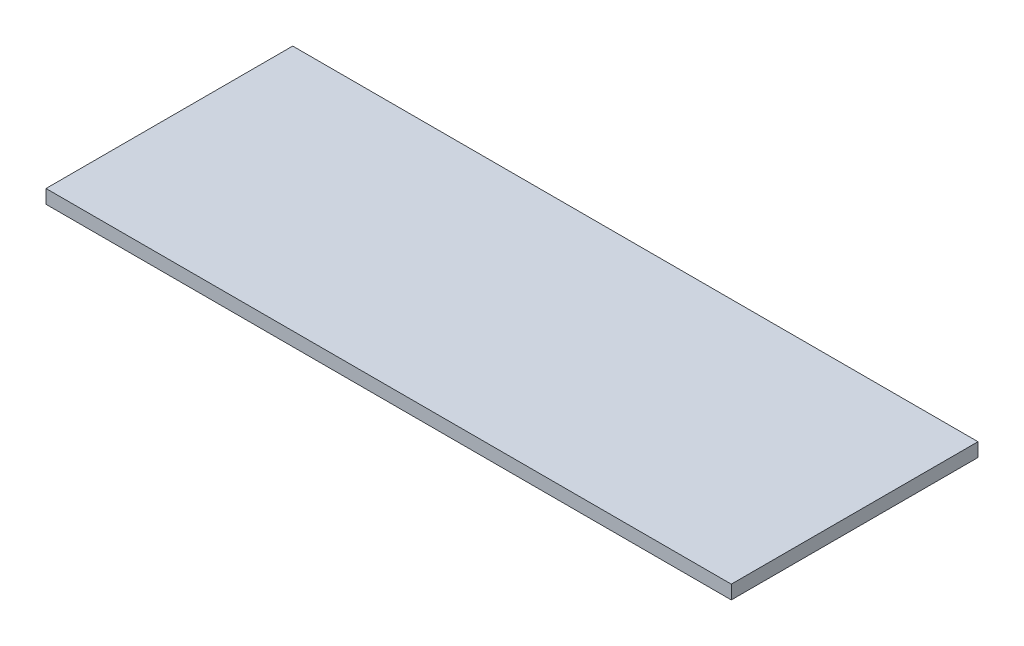
ISO-10303-21;
HEADER;
FILE_DESCRIPTION(('STEP AP214'),'2;1');
FILE_NAME('part.step','',(''),(''),'','','');
FILE_SCHEMA(('AUTOMOTIVE_DESIGN { 1 0 10303 214 1 1 1 1 }'));
ENDSEC;
DATA;
#1=APPLICATION_CONTEXT('core data for automotive mechanical design processes');
#2=APPLICATION_PROTOCOL_DEFINITION('international standard','automotive_design',2000,#1);
#3=PRODUCT_CONTEXT('',#1,'mechanical');
#4=PRODUCT('Part','Part','',(#3));
#5=PRODUCT_RELATED_PRODUCT_CATEGORY('part','',(#4));
#6=PRODUCT_DEFINITION_FORMATION('','',#4);
#7=PRODUCT_DEFINITION_CONTEXT('part definition',#1,'design');
#8=PRODUCT_DEFINITION('design','',#6,#7);
#9=PRODUCT_DEFINITION_SHAPE('','',#8);
#10=(LENGTH_UNIT() NAMED_UNIT(*) SI_UNIT(.MILLI.,.METRE.));
#11=(NAMED_UNIT(*) PLANE_ANGLE_UNIT() SI_UNIT($,.RADIAN.));
#12=(NAMED_UNIT(*) SI_UNIT($,.STERADIAN.) SOLID_ANGLE_UNIT());
#13=UNCERTAINTY_MEASURE_WITH_UNIT(LENGTH_MEASURE(1.E-05),#10,'distance_accuracy_value','');
#14=(GEOMETRIC_REPRESENTATION_CONTEXT(3) GLOBAL_UNCERTAINTY_ASSIGNED_CONTEXT((#13)) GLOBAL_UNIT_ASSIGNED_CONTEXT((#10,
#11,#12)) REPRESENTATION_CONTEXT('',''));
#15=CARTESIAN_POINT('',(0.,0.,0.));
#16=DIRECTION('',(0.,0.,1.));
#17=DIRECTION('',(1.,0.,0.));
#18=AXIS2_PLACEMENT_3D('',#15,#16,#17);
#19=CARTESIAN_POINT('',(125.,5.,-45.));
#20=DIRECTION('',(-1.,0.,0.));
#21=DIRECTION('',(0.,0.,1.));
#22=AXIS2_PLACEMENT_3D('',#19,#20,#21);
#23=PLANE('',#22);
#24=DIRECTION('',(0.,0.,-1.));
#25=VECTOR('',#24,1.);
#26=CARTESIAN_POINT('',(125.,0.,-45.));
#27=LINE('',#26,#25);
#28=CARTESIAN_POINT('',(125.,0.,45.));
#29=VERTEX_POINT('',#28);
#30=CARTESIAN_POINT('',(125.,0.,-45.));
#31=VERTEX_POINT('',#30);
#32=EDGE_CURVE('E111',#29,#31,#27,.T.);
#33=ORIENTED_EDGE('',*,*,#32,.T.);
#34=DIRECTION('',(0.,-1.,0.));
#35=VECTOR('',#34,1.);
#36=CARTESIAN_POINT('',(125.,5.,-45.));
#37=LINE('',#36,#35);
#38=CARTESIAN_POINT('',(125.,5.,-45.));
#39=VERTEX_POINT('',#38);
#40=EDGE_CURVE('E11',#39,#31,#37,.T.);
#41=ORIENTED_EDGE('',*,*,#40,.F.);
#42=DIRECTION('',(0.,0.,-1.));
#43=VECTOR('',#42,1.);
#44=CARTESIAN_POINT('',(125.,5.,-45.));
#45=LINE('',#44,#43);
#46=CARTESIAN_POINT('',(125.,5.,45.));
#47=VERTEX_POINT('',#46);
#48=EDGE_CURVE('E95',#47,#39,#45,.T.);
#49=ORIENTED_EDGE('',*,*,#48,.F.);
#50=DIRECTION('',(0.,-1.,0.));
#51=VECTOR('',#50,1.);
#52=CARTESIAN_POINT('',(125.,5.,45.));
#53=LINE('',#52,#51);
#54=EDGE_CURVE('E107',#47,#29,#53,.T.);
#55=ORIENTED_EDGE('',*,*,#54,.T.);
#56=EDGE_LOOP('',(#33,#41,#49,#55));
#57=FACE_BOUND('',#56,.T.);
#58=ADVANCED_FACE('F43',(#57),#23,.F.);
#59=CARTESIAN_POINT('',(-125.,5.,-45.));
#60=DIRECTION('',(0.,0.,1.));
#61=DIRECTION('',(1.,0.,0.));
#62=AXIS2_PLACEMENT_3D('',#59,#60,#61);
#63=PLANE('',#62);
#64=DIRECTION('',(-1.,0.,0.));
#65=VECTOR('',#64,1.);
#66=CARTESIAN_POINT('',(-125.,0.,-45.));
#67=LINE('',#66,#65);
#68=CARTESIAN_POINT('',(-125.,0.,-45.));
#69=VERTEX_POINT('',#68);
#70=EDGE_CURVE('E100',#31,#69,#67,.T.);
#71=ORIENTED_EDGE('',*,*,#70,.T.);
#72=DIRECTION('',(0.,-1.,0.));
#73=VECTOR('',#72,1.);
#74=CARTESIAN_POINT('',(-125.,5.,-45.));
#75=LINE('',#74,#73);
#76=CARTESIAN_POINT('',(-125.,5.,-45.));
#77=VERTEX_POINT('',#76);
#78=EDGE_CURVE('E52',#77,#69,#75,.T.);
#79=ORIENTED_EDGE('',*,*,#78,.F.);
#80=DIRECTION('',(-1.,0.,0.));
#81=VECTOR('',#80,1.);
#82=CARTESIAN_POINT('',(-125.,5.,-45.));
#83=LINE('',#82,#81);
#84=EDGE_CURVE('E90',#39,#77,#83,.T.);
#85=ORIENTED_EDGE('',*,*,#84,.F.);
#86=ORIENTED_EDGE('',*,*,#40,.T.);
#87=EDGE_LOOP('',(#71,#79,#85,#86));
#88=FACE_BOUND('',#87,.T.);
#89=ADVANCED_FACE('F99',(#88),#63,.F.);
#90=CARTESIAN_POINT('',(-125.,5.,-45.));
#91=DIRECTION('',(1.,0.,0.));
#92=DIRECTION('',(0.,0.,-1.));
#93=AXIS2_PLACEMENT_3D('',#90,#91,#92);
#94=PLANE('',#93);
#95=DIRECTION('',(0.,0.,1.));
#96=VECTOR('',#95,1.);
#97=CARTESIAN_POINT('',(-125.,0.,-45.));
#98=LINE('',#97,#96);
#99=CARTESIAN_POINT('',(-125.,0.,45.));
#100=VERTEX_POINT('',#99);
#101=EDGE_CURVE('E77',#69,#100,#98,.T.);
#102=ORIENTED_EDGE('',*,*,#101,.T.);
#103=DIRECTION('',(0.,-1.,0.));
#104=VECTOR('',#103,1.);
#105=CARTESIAN_POINT('',(-125.,5.,45.));
#106=LINE('',#105,#104);
#107=CARTESIAN_POINT('',(-125.,5.,45.));
#108=VERTEX_POINT('',#107);
#109=EDGE_CURVE('E102',#108,#100,#106,.T.);
#110=ORIENTED_EDGE('',*,*,#109,.F.);
#111=DIRECTION('',(0.,0.,1.));
#112=VECTOR('',#111,1.);
#113=CARTESIAN_POINT('',(-125.,5.,-45.));
#114=LINE('',#113,#112);
#115=EDGE_CURVE('E93',#77,#108,#114,.T.);
#116=ORIENTED_EDGE('',*,*,#115,.F.);
#117=ORIENTED_EDGE('',*,*,#78,.T.);
#118=EDGE_LOOP('',(#102,#110,#116,#117));
#119=FACE_BOUND('',#118,.T.);
#120=ADVANCED_FACE('F103',(#119),#94,.F.);
#121=CARTESIAN_POINT('',(-125.,5.,45.));
#122=DIRECTION('',(0.,0.,-1.));
#123=DIRECTION('',(-1.,0.,0.));
#124=AXIS2_PLACEMENT_3D('',#121,#122,#123);
#125=PLANE('',#124);
#126=DIRECTION('',(1.,0.,0.));
#127=VECTOR('',#126,1.);
#128=CARTESIAN_POINT('',(-125.,0.,45.));
#129=LINE('',#128,#127);
#130=EDGE_CURVE('E83',#100,#29,#129,.T.);
#131=ORIENTED_EDGE('',*,*,#130,.T.);
#132=ORIENTED_EDGE('',*,*,#54,.F.);
#133=DIRECTION('',(1.,0.,0.));
#134=VECTOR('',#133,1.);
#135=CARTESIAN_POINT('',(-125.,5.,45.));
#136=LINE('',#135,#134);
#137=EDGE_CURVE('E60',#108,#47,#136,.T.);
#138=ORIENTED_EDGE('',*,*,#137,.F.);
#139=ORIENTED_EDGE('',*,*,#109,.T.);
#140=EDGE_LOOP('',(#131,#132,#138,#139));
#141=FACE_BOUND('',#140,.T.);
#142=ADVANCED_FACE('F124',(#141),#125,.F.);
#143=CARTESIAN_POINT('',(0.,5.,0.));
#144=DIRECTION('',(0.,1.,0.));
#145=DIRECTION('',(0.,0.,1.));
#146=AXIS2_PLACEMENT_3D('',#143,#144,#145);
#147=PLANE('',#146);
#148=ORIENTED_EDGE('',*,*,#48,.T.);
#149=ORIENTED_EDGE('',*,*,#84,.T.);
#150=ORIENTED_EDGE('',*,*,#115,.T.);
#151=ORIENTED_EDGE('',*,*,#137,.T.);
#152=EDGE_LOOP('',(#148,#149,#150,#151));
#153=FACE_BOUND('',#152,.T.);
#154=ADVANCED_FACE('F91',(#153),#147,.T.);
#155=CARTESIAN_POINT('',(0.,0.,0.));
#156=DIRECTION('',(0.,1.,0.));
#157=DIRECTION('',(0.,0.,1.));
#158=AXIS2_PLACEMENT_3D('',#155,#156,#157);
#159=PLANE('',#158);
#160=ORIENTED_EDGE('',*,*,#32,.F.);
#161=ORIENTED_EDGE('',*,*,#130,.F.);
#162=ORIENTED_EDGE('',*,*,#101,.F.);
#163=ORIENTED_EDGE('',*,*,#70,.F.);
#164=EDGE_LOOP('',(#160,#161,#162,#163));
#165=FACE_BOUND('',#164,.T.);
#166=ADVANCED_FACE('F127',(#165),#159,.F.);
#167=CLOSED_SHELL('',(#58,#89,#120,#142,#154,#166));
#168=MANIFOLD_SOLID_BREP('B2',#167);
#169=ADVANCED_BREP_SHAPE_REPRESENTATION('',(#18,#168),#14);
#170=SHAPE_DEFINITION_REPRESENTATION(#9,#169);
ENDSEC;
END-ISO-10303-21;
